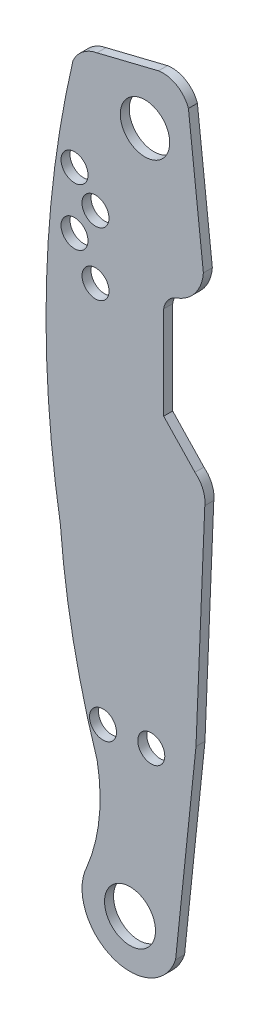
ISO-10303-21;
HEADER;
FILE_DESCRIPTION(('STEP AP214'),'2;1');
FILE_NAME('part.step','',(''),(''),'','','');
FILE_SCHEMA(('AUTOMOTIVE_DESIGN { 1 0 10303 214 1 1 1 1 }'));
ENDSEC;
DATA;
#1=APPLICATION_CONTEXT('core data for automotive mechanical design processes');
#2=APPLICATION_PROTOCOL_DEFINITION('international standard','automotive_design',2000,#1);
#3=PRODUCT_CONTEXT('',#1,'mechanical');
#4=PRODUCT('Part','Part','',(#3));
#5=PRODUCT_RELATED_PRODUCT_CATEGORY('part','',(#4));
#6=PRODUCT_DEFINITION_FORMATION('','',#4);
#7=PRODUCT_DEFINITION_CONTEXT('part definition',#1,'design');
#8=PRODUCT_DEFINITION('design','',#6,#7);
#9=PRODUCT_DEFINITION_SHAPE('','',#8);
#10=(LENGTH_UNIT() NAMED_UNIT(*) SI_UNIT(.MILLI.,.METRE.));
#11=(NAMED_UNIT(*) PLANE_ANGLE_UNIT() SI_UNIT($,.RADIAN.));
#12=(NAMED_UNIT(*) SI_UNIT($,.STERADIAN.) SOLID_ANGLE_UNIT());
#13=UNCERTAINTY_MEASURE_WITH_UNIT(LENGTH_MEASURE(1.E-05),#10,'distance_accuracy_value','');
#14=(GEOMETRIC_REPRESENTATION_CONTEXT(3) GLOBAL_UNCERTAINTY_ASSIGNED_CONTEXT((#13)) GLOBAL_UNIT_ASSIGNED_CONTEXT((#10,
#11,#12)) REPRESENTATION_CONTEXT('',''));
#15=CARTESIAN_POINT('',(0.,0.,0.));
#16=DIRECTION('',(0.,0.,1.));
#17=DIRECTION('',(1.,0.,0.));
#18=AXIS2_PLACEMENT_3D('',#15,#16,#17);
#19=CARTESIAN_POINT('',(66.1355331619009,46.4667637732928,0.381));
#20=DIRECTION('',(0.,0.,-1.));
#21=DIRECTION('',(-1.,0.,0.));
#22=AXIS2_PLACEMENT_3D('',#19,#20,#21);
#23=PLANE('',#22);
#24=CARTESIAN_POINT('',(66.1355331619009,46.4667637732928,0.381));
#25=DIRECTION('',(0.,0.,1.));
#26=DIRECTION('',(-1.,0.,0.));
#27=AXIS2_PLACEMENT_3D('',#24,#25,#26);
#28=CIRCLE('',#27,2.79400000000001);
#29=CARTESIAN_POINT('',(65.6275331619009,49.2141938451963,0.381));
#30=VERTEX_POINT('',#29);
#31=CARTESIAN_POINT('',(63.5895969047931,47.6176958193944,0.381));
#32=VERTEX_POINT('',#31);
#33=EDGE_CURVE('E203',#30,#32,#28,.T.);
#34=ORIENTED_EDGE('',*,*,#33,.T.);
#35=CARTESIAN_POINT('',(149.701533161901,27.6707637732928,0.381));
#36=DIRECTION('',(0.,0.,1.));
#37=DIRECTION('',(1.,0.,0.));
#38=AXIS2_PLACEMENT_3D('',#35,#36,#37);
#39=CIRCLE('',#38,88.392);
#40=CARTESIAN_POINT('',(62.5267867779124,13.051965707539,0.381));
#41=VERTEX_POINT('',#40);
#42=EDGE_CURVE('E116',#32,#41,#39,.T.);
#43=ORIENTED_EDGE('',*,*,#42,.T.);
#44=CARTESIAN_POINT('',(130.143533161901,18.2727637732928,0.381));
#45=DIRECTION('',(0.,0.,1.));
#46=DIRECTION('',(1.,0.,0.));
#47=AXIS2_PLACEMENT_3D('',#44,#45,#46);
#48=CIRCLE('',#47,67.818);
#49=CARTESIAN_POINT('',(65.6357854012129,-2.65644077067999,0.381));
#50=VERTEX_POINT('',#49);
#51=EDGE_CURVE('E239',#41,#50,#48,.T.);
#52=ORIENTED_EDGE('',*,*,#51,.T.);
#53=CARTESIAN_POINT('',(51.4035331619009,-5.34923622670723,0.381));
#54=DIRECTION('',(0.,0.,-1.));
#55=DIRECTION('',(-1.,0.,0.));
#56=AXIS2_PLACEMENT_3D('',#53,#54,#55);
#57=CIRCLE('',#56,14.4847558202202);
#58=CARTESIAN_POINT('',(64.7663699352265,-10.9387571847912,0.381));
#59=VERTEX_POINT('',#58);
#60=EDGE_CURVE('E258',#50,#59,#57,.T.);
#61=ORIENTED_EDGE('',*,*,#60,.T.);
#62=CARTESIAN_POINT('',(68.4215331619009,-12.7152362267072,0.381));
#63=DIRECTION('',(0.,0.,1.));
#64=DIRECTION('',(1.,0.,0.));
#65=AXIS2_PLACEMENT_3D('',#62,#63,#64);
#66=CIRCLE('',#65,4.064);
#67=CARTESIAN_POINT('',(72.2819989369079,-13.9852362267072,0.381));
#68=VERTEX_POINT('',#67);
#69=EDGE_CURVE('E255',#59,#68,#66,.T.);
#70=ORIENTED_EDGE('',*,*,#69,.T.);
#71=DIRECTION('',(0.104067481894806,0.994570238450796,0.));
#72=VECTOR('',#71,1.);
#73=CARTESIAN_POINT('',(74.0095331619009,2.52476377329277,0.381));
#74=LINE('',#73,#72);
#75=CARTESIAN_POINT('',(74.0095331619009,2.52476377329277,0.381));
#76=VERTEX_POINT('',#75);
#77=EDGE_CURVE('E257',#68,#76,#74,.T.);
#78=ORIENTED_EDGE('',*,*,#77,.T.);
#79=DIRECTION('',(0.0414330086927801,0.999141284198918,0.));
#80=VECTOR('',#79,1.);
#81=CARTESIAN_POINT('',(74.7573782270407,20.5587637732928,0.381));
#82=LINE('',#81,#80);
#83=CARTESIAN_POINT('',(74.7573782270407,20.5587637732928,0.381));
#84=VERTEX_POINT('',#83);
#85=EDGE_CURVE('E260',#76,#84,#82,.T.);
#86=ORIENTED_EDGE('',*,*,#85,.T.);
#87=CARTESIAN_POINT('',(72.4855331619009,20.8127637732928,0.381));
#88=DIRECTION('',(0.,0.,1.));
#89=DIRECTION('',(1.,0.,0.));
#90=AXIS2_PLACEMENT_3D('',#87,#88,#89);
#91=CIRCLE('',#90,2.286);
#92=CARTESIAN_POINT('',(73.922374141272,22.5907637732928,0.381));
#93=VERTEX_POINT('',#92);
#94=EDGE_CURVE('E266',#84,#93,#91,.T.);
#95=ORIENTED_EDGE('',*,*,#94,.T.);
#96=DIRECTION('',(-0.68782056768285,0.725880752377718,0.));
#97=VECTOR('',#96,1.);
#98=CARTESIAN_POINT('',(71.274872248143,25.3847637732928,0.381));
#99=LINE('',#98,#97);
#100=CARTESIAN_POINT('',(71.274872248143,25.3847637732928,0.381));
#101=VERTEX_POINT('',#100);
#102=EDGE_CURVE('E268',#93,#101,#99,.T.);
#103=ORIENTED_EDGE('',*,*,#102,.T.);
#104=DIRECTION('',(0.,1.,0.));
#105=VECTOR('',#104,1.);
#106=CARTESIAN_POINT('',(71.274872248143,33.2587637732928,0.381));
#107=LINE('',#106,#105);
#108=CARTESIAN_POINT('',(71.274872248143,33.2587637732928,0.381));
#109=VERTEX_POINT('',#108);
#110=EDGE_CURVE('E270',#101,#109,#107,.T.);
#111=ORIENTED_EDGE('',*,*,#110,.T.);
#112=CARTESIAN_POINT('',(72.9576102669683,33.0047637732928,0.381));
#113=DIRECTION('',(0.,0.,-1.));
#114=DIRECTION('',(-1.,0.,0.));
#115=AXIS2_PLACEMENT_3D('',#112,#113,#114);
#116=CIRCLE('',#115,1.7018);
#117=CARTESIAN_POINT('',(72.3797926133073,34.6054667435898,0.381));
#118=VERTEX_POINT('',#117);
#119=EDGE_CURVE('E272',#109,#118,#116,.T.);
#120=ORIENTED_EDGE('',*,*,#119,.T.);
#121=CARTESIAN_POINT('',(71.2155331619009,37.8307637732928,0.381));
#122=DIRECTION('',(0.,0.,1.));
#123=DIRECTION('',(1.,0.,0.));
#124=AXIS2_PLACEMENT_3D('',#121,#122,#123);
#125=CIRCLE('',#124,3.429);
#126=CARTESIAN_POINT('',(74.6351128144313,37.5767637732928,0.381));
#127=VERTEX_POINT('',#126);
#128=EDGE_CURVE('E156',#118,#127,#125,.T.);
#129=ORIENTED_EDGE('',*,*,#128,.T.);
#130=DIRECTION('',(-0.109943454836224,0.993937843498614,0.));
#131=VECTOR('',#130,1.);
#132=CARTESIAN_POINT('',(73.3707946309575,49.0067637732928,0.381));
#133=LINE('',#132,#131);
#134=CARTESIAN_POINT('',(73.3707946309575,49.0067637732928,0.381));
#135=VERTEX_POINT('',#134);
#136=EDGE_CURVE('E150',#127,#135,#133,.T.);
#137=ORIENTED_EDGE('',*,*,#136,.T.);
#138=CARTESIAN_POINT('',(71.2155331619009,48.2447637732928,0.381));
#139=DIRECTION('',(0.,0.,1.));
#140=DIRECTION('',(-1.,0.,0.));
#141=AXIS2_PLACEMENT_3D('',#138,#139,#140);
#142=CIRCLE('',#141,2.28600000000001);
#143=CARTESIAN_POINT('',(70.8345331619009,50.4987901706537,0.381));
#144=VERTEX_POINT('',#143);
#145=EDGE_CURVE('E154',#135,#144,#142,.T.);
#146=ORIENTED_EDGE('',*,*,#145,.T.);
#147=DIRECTION('',(-0.970890406584158,-0.239524149936595,0.));
#148=VECTOR('',#147,1.);
#149=CARTESIAN_POINT('',(65.6275331619009,49.2141938451963,0.381));
#150=LINE('',#149,#148);
#151=EDGE_CURVE('E52',#144,#30,#150,.T.);
#152=ORIENTED_EDGE('',*,*,#151,.T.);
#153=EDGE_LOOP('',(#34,#43,#52,#61,#70,#78,#86,#95,#103,#111,#120,#129,#137,#146,#152));
#154=FACE_BOUND('',#153,.T.);
#155=CARTESIAN_POINT('',(68.4215331619009,-12.7152362267072,0.381));
#156=DIRECTION('',(0.,0.,1.));
#157=DIRECTION('',(1.,0.,0.));
#158=AXIS2_PLACEMENT_3D('',#155,#156,#157);
#159=CIRCLE('',#158,2.15899999999999);
#160=CARTESIAN_POINT('',(70.5805331619009,-12.7152362267072,0.381));
#161=VERTEX_POINT('',#160);
#162=EDGE_CURVE('E178',#161,#161,#159,.T.);
#163=ORIENTED_EDGE('',*,*,#162,.F.);
#164=EDGE_LOOP('',(#163));
#165=FACE_BOUND('',#164,.T.);
#166=CARTESIAN_POINT('',(70.2249331619009,0.492763773292777,0.381));
#167=DIRECTION('',(0.,0.,1.));
#168=DIRECTION('',(1.,0.,0.));
#169=AXIS2_PLACEMENT_3D('',#166,#167,#168);
#170=CIRCLE('',#169,1.143);
#171=CARTESIAN_POINT('',(71.3679331619009,0.492763773292777,0.381));
#172=VERTEX_POINT('',#171);
#173=EDGE_CURVE('E376',#172,#172,#170,.T.);
#174=ORIENTED_EDGE('',*,*,#173,.F.);
#175=EDGE_LOOP('',(#174));
#176=FACE_BOUND('',#175,.T.);
#177=CARTESIAN_POINT('',(66.1355331619009,0.202809344150783,0.381));
#178=DIRECTION('',(0.,0.,1.));
#179=DIRECTION('',(1.,0.,0.));
#180=AXIS2_PLACEMENT_3D('',#177,#178,#179);
#181=CIRCLE('',#180,1.14299999999999);
#182=CARTESIAN_POINT('',(67.2785331619009,0.202809344150783,0.381));
#183=VERTEX_POINT('',#182);
#184=EDGE_CURVE('E370',#183,#183,#181,.T.);
#185=ORIENTED_EDGE('',*,*,#184,.F.);
#186=EDGE_LOOP('',(#185));
#187=FACE_BOUND('',#186,.T.);
#188=CARTESIAN_POINT('',(65.5005331619009,32.2427637732928,0.381));
#189=DIRECTION('',(0.,0.,1.));
#190=DIRECTION('',(1.,0.,0.));
#191=AXIS2_PLACEMENT_3D('',#188,#189,#190);
#192=CIRCLE('',#191,1.143);
#193=CARTESIAN_POINT('',(66.6435331619009,32.2427637732928,0.381));
#194=VERTEX_POINT('',#193);
#195=EDGE_CURVE('E364',#194,#194,#192,.T.);
#196=ORIENTED_EDGE('',*,*,#195,.F.);
#197=EDGE_LOOP('',(#196));
#198=FACE_BOUND('',#197,.T.);
#199=CARTESIAN_POINT('',(65.5005331619009,37.5767637732928,0.381));
#200=DIRECTION('',(0.,0.,1.));
#201=DIRECTION('',(1.,0.,0.));
#202=AXIS2_PLACEMENT_3D('',#199,#200,#201);
#203=CIRCLE('',#202,1.143);
#204=CARTESIAN_POINT('',(66.6435331619009,37.5767637732928,0.381));
#205=VERTEX_POINT('',#204);
#206=EDGE_CURVE('E358',#205,#205,#203,.T.);
#207=ORIENTED_EDGE('',*,*,#206,.F.);
#208=EDGE_LOOP('',(#207));
#209=FACE_BOUND('',#208,.T.);
#210=CARTESIAN_POINT('',(69.6915331619009,45.7047637732928,0.381));
#211=DIRECTION('',(0.,0.,1.));
#212=DIRECTION('',(1.,0.,0.));
#213=AXIS2_PLACEMENT_3D('',#210,#211,#212);
#214=CIRCLE('',#213,2.0955);
#215=CARTESIAN_POINT('',(71.7870331619009,45.7047637732928,0.381));
#216=VERTEX_POINT('',#215);
#217=EDGE_CURVE('E352',#216,#216,#214,.T.);
#218=ORIENTED_EDGE('',*,*,#217,.F.);
#219=EDGE_LOOP('',(#218));
#220=FACE_BOUND('',#219,.T.);
#221=CARTESIAN_POINT('',(63.7225331619009,39.8627637732928,0.381));
#222=DIRECTION('',(0.,0.,1.));
#223=DIRECTION('',(1.,0.,0.));
#224=AXIS2_PLACEMENT_3D('',#221,#222,#223);
#225=CIRCLE('',#224,1.14299999999999);
#226=CARTESIAN_POINT('',(64.8655331619009,39.8627637732928,0.381));
#227=VERTEX_POINT('',#226);
#228=EDGE_CURVE('E346',#227,#227,#225,.T.);
#229=ORIENTED_EDGE('',*,*,#228,.F.);
#230=EDGE_LOOP('',(#229));
#231=FACE_BOUND('',#230,.T.);
#232=CARTESIAN_POINT('',(63.7225331619009,35.0367637732928,0.381));
#233=DIRECTION('',(0.,0.,1.));
#234=DIRECTION('',(1.,0.,0.));
#235=AXIS2_PLACEMENT_3D('',#232,#233,#234);
#236=CIRCLE('',#235,1.14299999999999);
#237=CARTESIAN_POINT('',(64.8655331619009,35.0367637732928,0.381));
#238=VERTEX_POINT('',#237);
#239=EDGE_CURVE('E337',#238,#238,#236,.T.);
#240=ORIENTED_EDGE('',*,*,#239,.F.);
#241=EDGE_LOOP('',(#240));
#242=FACE_BOUND('',#241,.T.);
#243=ADVANCED_FACE('F35',(#154,#165,#176,#187,#198,#209,#220,#231,#242),#23,.F.);
#244=CARTESIAN_POINT('',(66.1355331619009,46.4667637732928,-0.381));
#245=DIRECTION('',(0.,0.,-1.));
#246=DIRECTION('',(-1.,0.,0.));
#247=AXIS2_PLACEMENT_3D('',#244,#245,#246);
#248=PLANE('',#247);
#249=CARTESIAN_POINT('',(63.7225331619009,39.8627637732928,-0.381));
#250=DIRECTION('',(0.,0.,1.));
#251=DIRECTION('',(1.,0.,0.));
#252=AXIS2_PLACEMENT_3D('',#249,#250,#251);
#253=CIRCLE('',#252,1.14299999999999);
#254=CARTESIAN_POINT('',(64.8655331619009,39.8627637732928,-0.381));
#255=VERTEX_POINT('',#254);
#256=EDGE_CURVE('E343',#255,#255,#253,.T.);
#257=ORIENTED_EDGE('',*,*,#256,.T.);
#258=EDGE_LOOP('',(#257));
#259=FACE_BOUND('',#258,.T.);
#260=CARTESIAN_POINT('',(65.5005331619009,37.5767637732928,-0.381));
#261=DIRECTION('',(0.,0.,1.));
#262=DIRECTION('',(1.,0.,0.));
#263=AXIS2_PLACEMENT_3D('',#260,#261,#262);
#264=CIRCLE('',#263,1.143);
#265=CARTESIAN_POINT('',(66.6435331619009,37.5767637732928,-0.381));
#266=VERTEX_POINT('',#265);
#267=EDGE_CURVE('E355',#266,#266,#264,.T.);
#268=ORIENTED_EDGE('',*,*,#267,.T.);
#269=EDGE_LOOP('',(#268));
#270=FACE_BOUND('',#269,.T.);
#271=CARTESIAN_POINT('',(66.1355331619009,0.202809344150783,-0.381));
#272=DIRECTION('',(0.,0.,1.));
#273=DIRECTION('',(1.,0.,0.));
#274=AXIS2_PLACEMENT_3D('',#271,#272,#273);
#275=CIRCLE('',#274,1.14299999999999);
#276=CARTESIAN_POINT('',(67.2785331619009,0.202809344150783,-0.381));
#277=VERTEX_POINT('',#276);
#278=EDGE_CURVE('E367',#277,#277,#275,.T.);
#279=ORIENTED_EDGE('',*,*,#278,.T.);
#280=EDGE_LOOP('',(#279));
#281=FACE_BOUND('',#280,.T.);
#282=CARTESIAN_POINT('',(68.4215331619009,-12.7152362267072,-0.381));
#283=DIRECTION('',(0.,0.,1.));
#284=DIRECTION('',(1.,0.,0.));
#285=AXIS2_PLACEMENT_3D('',#282,#283,#284);
#286=CIRCLE('',#285,2.15899999999999);
#287=CARTESIAN_POINT('',(70.5805331619009,-12.7152362267072,-0.381));
#288=VERTEX_POINT('',#287);
#289=EDGE_CURVE('E379',#288,#288,#286,.T.);
#290=ORIENTED_EDGE('',*,*,#289,.T.);
#291=EDGE_LOOP('',(#290));
#292=FACE_BOUND('',#291,.T.);
#293=CARTESIAN_POINT('',(66.1355331619009,46.4667637732928,-0.381));
#294=DIRECTION('',(0.,0.,1.));
#295=DIRECTION('',(-1.,0.,0.));
#296=AXIS2_PLACEMENT_3D('',#293,#294,#295);
#297=CIRCLE('',#296,2.79400000000001);
#298=CARTESIAN_POINT('',(65.6275331619009,49.2141938451963,-0.381));
#299=VERTEX_POINT('',#298);
#300=CARTESIAN_POINT('',(63.5895969047931,47.6176958193944,-0.381));
#301=VERTEX_POINT('',#300);
#302=EDGE_CURVE('E174',#299,#301,#297,.T.);
#303=ORIENTED_EDGE('',*,*,#302,.F.);
#304=DIRECTION('',(-0.970890406584158,-0.239524149936595,0.));
#305=VECTOR('',#304,1.);
#306=CARTESIAN_POINT('',(65.6275331619009,49.2141938451963,-0.381));
#307=LINE('',#306,#305);
#308=CARTESIAN_POINT('',(70.8345331619009,50.4987901706537,-0.381));
#309=VERTEX_POINT('',#308);
#310=EDGE_CURVE('E108',#309,#299,#307,.T.);
#311=ORIENTED_EDGE('',*,*,#310,.F.);
#312=CARTESIAN_POINT('',(71.2155331619009,48.2447637732928,-0.381));
#313=DIRECTION('',(0.,0.,1.));
#314=DIRECTION('',(-1.,0.,0.));
#315=AXIS2_PLACEMENT_3D('',#312,#313,#314);
#316=CIRCLE('',#315,2.28600000000001);
#317=CARTESIAN_POINT('',(73.3707946309575,49.0067637732928,-0.381));
#318=VERTEX_POINT('',#317);
#319=EDGE_CURVE('E102',#318,#309,#316,.T.);
#320=ORIENTED_EDGE('',*,*,#319,.F.);
#321=DIRECTION('',(-0.109943454836224,0.993937843498614,0.));
#322=VECTOR('',#321,1.);
#323=CARTESIAN_POINT('',(73.3707946309575,49.0067637732928,-0.381));
#324=LINE('',#323,#322);
#325=CARTESIAN_POINT('',(74.6351128144313,37.5767637732928,-0.381));
#326=VERTEX_POINT('',#325);
#327=EDGE_CURVE('E164',#326,#318,#324,.T.);
#328=ORIENTED_EDGE('',*,*,#327,.F.);
#329=CARTESIAN_POINT('',(71.2155331619009,37.8307637732928,-0.381));
#330=DIRECTION('',(0.,0.,1.));
#331=DIRECTION('',(1.,0.,0.));
#332=AXIS2_PLACEMENT_3D('',#329,#330,#331);
#333=CIRCLE('',#332,3.429);
#334=CARTESIAN_POINT('',(72.3797926133073,34.6054667435898,-0.381));
#335=VERTEX_POINT('',#334);
#336=EDGE_CURVE('E198',#335,#326,#333,.T.);
#337=ORIENTED_EDGE('',*,*,#336,.F.);
#338=CARTESIAN_POINT('',(72.9576102669683,33.0047637732928,-0.381));
#339=DIRECTION('',(0.,0.,-1.));
#340=DIRECTION('',(-1.,0.,0.));
#341=AXIS2_PLACEMENT_3D('',#338,#339,#340);
#342=CIRCLE('',#341,1.7018);
#343=CARTESIAN_POINT('',(71.274872248143,33.2587637732928,-0.381));
#344=VERTEX_POINT('',#343);
#345=EDGE_CURVE('E196',#344,#335,#342,.T.);
#346=ORIENTED_EDGE('',*,*,#345,.F.);
#347=DIRECTION('',(0.,1.,0.));
#348=VECTOR('',#347,1.);
#349=CARTESIAN_POINT('',(71.274872248143,33.2587637732928,-0.381));
#350=LINE('',#349,#348);
#351=CARTESIAN_POINT('',(71.274872248143,25.3847637732928,-0.381));
#352=VERTEX_POINT('',#351);
#353=EDGE_CURVE('E194',#352,#344,#350,.T.);
#354=ORIENTED_EDGE('',*,*,#353,.F.);
#355=DIRECTION('',(-0.68782056768285,0.725880752377718,0.));
#356=VECTOR('',#355,1.);
#357=CARTESIAN_POINT('',(71.274872248143,25.3847637732928,-0.381));
#358=LINE('',#357,#356);
#359=CARTESIAN_POINT('',(73.922374141272,22.5907637732928,-0.381));
#360=VERTEX_POINT('',#359);
#361=EDGE_CURVE('E192',#360,#352,#358,.T.);
#362=ORIENTED_EDGE('',*,*,#361,.F.);
#363=CARTESIAN_POINT('',(72.4855331619009,20.8127637732928,-0.381));
#364=DIRECTION('',(0.,0.,1.));
#365=DIRECTION('',(1.,0.,0.));
#366=AXIS2_PLACEMENT_3D('',#363,#364,#365);
#367=CIRCLE('',#366,2.286);
#368=CARTESIAN_POINT('',(74.7573782270407,20.5587637732928,-0.381));
#369=VERTEX_POINT('',#368);
#370=EDGE_CURVE('E190',#369,#360,#367,.T.);
#371=ORIENTED_EDGE('',*,*,#370,.F.);
#372=DIRECTION('',(0.0414330086927801,0.999141284198918,0.));
#373=VECTOR('',#372,1.);
#374=CARTESIAN_POINT('',(74.7573782270407,20.5587637732928,-0.381));
#375=LINE('',#374,#373);
#376=CARTESIAN_POINT('',(74.0095331619009,2.52476377329277,-0.381));
#377=VERTEX_POINT('',#376);
#378=EDGE_CURVE('E188',#377,#369,#375,.T.);
#379=ORIENTED_EDGE('',*,*,#378,.F.);
#380=DIRECTION('',(0.104067481894806,0.994570238450796,0.));
#381=VECTOR('',#380,1.);
#382=CARTESIAN_POINT('',(74.0095331619009,2.52476377329277,-0.381));
#383=LINE('',#382,#381);
#384=CARTESIAN_POINT('',(72.2819989369079,-13.9852362267072,-0.381));
#385=VERTEX_POINT('',#384);
#386=EDGE_CURVE('E186',#385,#377,#383,.T.);
#387=ORIENTED_EDGE('',*,*,#386,.F.);
#388=CARTESIAN_POINT('',(68.4215331619009,-12.7152362267072,-0.381));
#389=DIRECTION('',(0.,0.,1.));
#390=DIRECTION('',(1.,0.,0.));
#391=AXIS2_PLACEMENT_3D('',#388,#389,#390);
#392=CIRCLE('',#391,4.064);
#393=CARTESIAN_POINT('',(64.7663699352265,-10.9387571847912,-0.381));
#394=VERTEX_POINT('',#393);
#395=EDGE_CURVE('E184',#394,#385,#392,.T.);
#396=ORIENTED_EDGE('',*,*,#395,.F.);
#397=CARTESIAN_POINT('',(51.4035331619009,-5.34923622670723,-0.381));
#398=DIRECTION('',(0.,0.,-1.));
#399=DIRECTION('',(-1.,0.,0.));
#400=AXIS2_PLACEMENT_3D('',#397,#398,#399);
#401=CIRCLE('',#400,14.4847558202202);
#402=CARTESIAN_POINT('',(65.6357854012129,-2.65644077067999,-0.381));
#403=VERTEX_POINT('',#402);
#404=EDGE_CURVE('E182',#403,#394,#401,.T.);
#405=ORIENTED_EDGE('',*,*,#404,.F.);
#406=CARTESIAN_POINT('',(130.143533161901,18.2727637732928,-0.381));
#407=DIRECTION('',(0.,0.,1.));
#408=DIRECTION('',(1.,0.,0.));
#409=AXIS2_PLACEMENT_3D('',#406,#407,#408);
#410=CIRCLE('',#409,67.818);
#411=CARTESIAN_POINT('',(62.5267867779124,13.051965707539,-0.381));
#412=VERTEX_POINT('',#411);
#413=EDGE_CURVE('E180',#412,#403,#410,.T.);
#414=ORIENTED_EDGE('',*,*,#413,.F.);
#415=CARTESIAN_POINT('',(149.701533161901,27.6707637732928,-0.381));
#416=DIRECTION('',(0.,0.,1.));
#417=DIRECTION('',(1.,0.,0.));
#418=AXIS2_PLACEMENT_3D('',#415,#416,#417);
#419=CIRCLE('',#418,88.392);
#420=EDGE_CURVE('E177',#301,#412,#419,.T.);
#421=ORIENTED_EDGE('',*,*,#420,.F.);
#422=EDGE_LOOP('',(#303,#311,#320,#328,#337,#346,#354,#362,#371,#379,#387,#396,#405,#414,#421));
#423=FACE_BOUND('',#422,.T.);
#424=CARTESIAN_POINT('',(70.2249331619009,0.492763773292777,-0.381));
#425=DIRECTION('',(0.,0.,1.));
#426=DIRECTION('',(1.,0.,0.));
#427=AXIS2_PLACEMENT_3D('',#424,#425,#426);
#428=CIRCLE('',#427,1.143);
#429=CARTESIAN_POINT('',(71.3679331619009,0.492763773292777,-0.381));
#430=VERTEX_POINT('',#429);
#431=EDGE_CURVE('E373',#430,#430,#428,.T.);
#432=ORIENTED_EDGE('',*,*,#431,.T.);
#433=EDGE_LOOP('',(#432));
#434=FACE_BOUND('',#433,.T.);
#435=CARTESIAN_POINT('',(65.5005331619009,32.2427637732928,-0.381));
#436=DIRECTION('',(0.,0.,1.));
#437=DIRECTION('',(1.,0.,0.));
#438=AXIS2_PLACEMENT_3D('',#435,#436,#437);
#439=CIRCLE('',#438,1.143);
#440=CARTESIAN_POINT('',(66.6435331619009,32.2427637732928,-0.381));
#441=VERTEX_POINT('',#440);
#442=EDGE_CURVE('E361',#441,#441,#439,.T.);
#443=ORIENTED_EDGE('',*,*,#442,.T.);
#444=EDGE_LOOP('',(#443));
#445=FACE_BOUND('',#444,.T.);
#446=CARTESIAN_POINT('',(69.6915331619009,45.7047637732928,-0.381));
#447=DIRECTION('',(0.,0.,1.));
#448=DIRECTION('',(1.,0.,0.));
#449=AXIS2_PLACEMENT_3D('',#446,#447,#448);
#450=CIRCLE('',#449,2.0955);
#451=CARTESIAN_POINT('',(71.7870331619009,45.7047637732928,-0.381));
#452=VERTEX_POINT('',#451);
#453=EDGE_CURVE('E349',#452,#452,#450,.T.);
#454=ORIENTED_EDGE('',*,*,#453,.T.);
#455=EDGE_LOOP('',(#454));
#456=FACE_BOUND('',#455,.T.);
#457=CARTESIAN_POINT('',(63.7225331619009,35.0367637732928,-0.381));
#458=DIRECTION('',(0.,0.,1.));
#459=DIRECTION('',(1.,0.,0.));
#460=AXIS2_PLACEMENT_3D('',#457,#458,#459);
#461=CIRCLE('',#460,1.14299999999999);
#462=CARTESIAN_POINT('',(64.8655331619009,35.0367637732928,-0.381));
#463=VERTEX_POINT('',#462);
#464=EDGE_CURVE('E340',#463,#463,#461,.T.);
#465=ORIENTED_EDGE('',*,*,#464,.T.);
#466=EDGE_LOOP('',(#465));
#467=FACE_BOUND('',#466,.T.);
#468=ADVANCED_FACE('F243',(#259,#270,#281,#292,#423,#434,#445,#456,#467),#248,.T.);
#469=CARTESIAN_POINT('',(66.1355331619009,46.4667637732928,0.381));
#470=DIRECTION('',(0.,0.,-1.));
#471=DIRECTION('',(-1.,0.,0.));
#472=AXIS2_PLACEMENT_3D('',#469,#470,#471);
#473=CYLINDRICAL_SURFACE('',#472,2.79400000000001);
#474=ORIENTED_EDGE('',*,*,#302,.T.);
#475=DIRECTION('',(0.,0.,-1.));
#476=VECTOR('',#475,1.);
#477=CARTESIAN_POINT('',(63.5895969047931,47.6176958193944,0.381));
#478=LINE('',#477,#476);
#479=EDGE_CURVE('E11',#32,#301,#478,.T.);
#480=ORIENTED_EDGE('',*,*,#479,.F.);
#481=ORIENTED_EDGE('',*,*,#33,.F.);
#482=DIRECTION('',(0.,0.,-1.));
#483=VECTOR('',#482,1.);
#484=CARTESIAN_POINT('',(65.6275331619009,49.2141938451963,0.381));
#485=LINE('',#484,#483);
#486=EDGE_CURVE('E170',#30,#299,#485,.T.);
#487=ORIENTED_EDGE('',*,*,#486,.T.);
#488=EDGE_LOOP('',(#474,#480,#481,#487));
#489=FACE_BOUND('',#488,.T.);
#490=ADVANCED_FACE('F37',(#489),#473,.T.);
#491=CARTESIAN_POINT('',(149.701533161901,27.6707637732928,0.381));
#492=DIRECTION('',(0.,0.,-1.));
#493=DIRECTION('',(-1.,0.,0.));
#494=AXIS2_PLACEMENT_3D('',#491,#492,#493);
#495=CYLINDRICAL_SURFACE('',#494,88.392);
#496=ORIENTED_EDGE('',*,*,#420,.T.);
#497=DIRECTION('',(0.,0.,-1.));
#498=VECTOR('',#497,1.);
#499=CARTESIAN_POINT('',(62.5267867779124,13.051965707539,0.381));
#500=LINE('',#499,#498);
#501=EDGE_CURVE('E44',#41,#412,#500,.T.);
#502=ORIENTED_EDGE('',*,*,#501,.F.);
#503=ORIENTED_EDGE('',*,*,#42,.F.);
#504=ORIENTED_EDGE('',*,*,#479,.T.);
#505=EDGE_LOOP('',(#496,#502,#503,#504));
#506=FACE_BOUND('',#505,.T.);
#507=ADVANCED_FACE('F557',(#506),#495,.T.);
#508=CARTESIAN_POINT('',(130.143533161901,18.2727637732928,0.381));
#509=DIRECTION('',(0.,0.,-1.));
#510=DIRECTION('',(-1.,0.,0.));
#511=AXIS2_PLACEMENT_3D('',#508,#509,#510);
#512=CYLINDRICAL_SURFACE('',#511,67.818);
#513=ORIENTED_EDGE('',*,*,#413,.T.);
#514=DIRECTION('',(0.,0.,-1.));
#515=VECTOR('',#514,1.);
#516=CARTESIAN_POINT('',(65.6357854012129,-2.65644077067999,0.381));
#517=LINE('',#516,#515);
#518=EDGE_CURVE('E231',#50,#403,#517,.T.);
#519=ORIENTED_EDGE('',*,*,#518,.F.);
#520=ORIENTED_EDGE('',*,*,#51,.F.);
#521=ORIENTED_EDGE('',*,*,#501,.T.);
#522=EDGE_LOOP('',(#513,#519,#520,#521));
#523=FACE_BOUND('',#522,.T.);
#524=ADVANCED_FACE('F237',(#523),#512,.T.);
#525=CARTESIAN_POINT('',(51.4035331619009,-5.34923622670723,0.381));
#526=DIRECTION('',(0.,0.,-1.));
#527=DIRECTION('',(-1.,0.,0.));
#528=AXIS2_PLACEMENT_3D('',#525,#526,#527);
#529=CYLINDRICAL_SURFACE('',#528,14.4847558202202);
#530=ORIENTED_EDGE('',*,*,#404,.T.);
#531=DIRECTION('',(0.,0.,-1.));
#532=VECTOR('',#531,1.);
#533=CARTESIAN_POINT('',(64.7663699352265,-10.9387571847912,0.381));
#534=LINE('',#533,#532);
#535=EDGE_CURVE('E228',#59,#394,#534,.T.);
#536=ORIENTED_EDGE('',*,*,#535,.F.);
#537=ORIENTED_EDGE('',*,*,#60,.F.);
#538=ORIENTED_EDGE('',*,*,#518,.T.);
#539=EDGE_LOOP('',(#530,#536,#537,#538));
#540=FACE_BOUND('',#539,.T.);
#541=ADVANCED_FACE('F249',(#540),#529,.F.);
#542=CARTESIAN_POINT('',(68.4215331619009,-12.7152362267072,0.381));
#543=DIRECTION('',(0.,0.,-1.));
#544=DIRECTION('',(-1.,0.,0.));
#545=AXIS2_PLACEMENT_3D('',#542,#543,#544);
#546=CYLINDRICAL_SURFACE('',#545,4.064);
#547=ORIENTED_EDGE('',*,*,#395,.T.);
#548=DIRECTION('',(0.,0.,-1.));
#549=VECTOR('',#548,1.);
#550=CARTESIAN_POINT('',(72.2819989369079,-13.9852362267072,0.381));
#551=LINE('',#550,#549);
#552=EDGE_CURVE('E225',#68,#385,#551,.T.);
#553=ORIENTED_EDGE('',*,*,#552,.F.);
#554=ORIENTED_EDGE('',*,*,#69,.F.);
#555=ORIENTED_EDGE('',*,*,#535,.T.);
#556=EDGE_LOOP('',(#547,#553,#554,#555));
#557=FACE_BOUND('',#556,.T.);
#558=ADVANCED_FACE('F253',(#557),#546,.T.);
#559=CARTESIAN_POINT('',(74.0095331619009,2.52476377329277,0.381));
#560=DIRECTION('',(-0.994570238450797,0.104067481894806,0.));
#561=DIRECTION('',(-0.104067481894806,-0.994570238450797,0.));
#562=AXIS2_PLACEMENT_3D('',#559,#560,#561);
#563=PLANE('',#562);
#564=ORIENTED_EDGE('',*,*,#386,.T.);
#565=DIRECTION('',(0.,0.,-1.));
#566=VECTOR('',#565,1.);
#567=CARTESIAN_POINT('',(74.0095331619009,2.52476377329277,0.381));
#568=LINE('',#567,#566);
#569=EDGE_CURVE('E222',#76,#377,#568,.T.);
#570=ORIENTED_EDGE('',*,*,#569,.F.);
#571=ORIENTED_EDGE('',*,*,#77,.F.);
#572=ORIENTED_EDGE('',*,*,#552,.T.);
#573=EDGE_LOOP('',(#564,#570,#571,#572));
#574=FACE_BOUND('',#573,.T.);
#575=ADVANCED_FACE('F522',(#574),#563,.F.);
#576=CARTESIAN_POINT('',(74.7573782270407,20.5587637732928,0.381));
#577=DIRECTION('',(-0.999141284198918,0.0414330086927801,0.));
#578=DIRECTION('',(-0.0414330086927802,-0.999141284198919,0.));
#579=AXIS2_PLACEMENT_3D('',#576,#577,#578);
#580=PLANE('',#579);
#581=ORIENTED_EDGE('',*,*,#378,.T.);
#582=DIRECTION('',(0.,0.,-1.));
#583=VECTOR('',#582,1.);
#584=CARTESIAN_POINT('',(74.7573782270407,20.5587637732928,0.381));
#585=LINE('',#584,#583);
#586=EDGE_CURVE('E219',#84,#369,#585,.T.);
#587=ORIENTED_EDGE('',*,*,#586,.F.);
#588=ORIENTED_EDGE('',*,*,#85,.F.);
#589=ORIENTED_EDGE('',*,*,#569,.T.);
#590=EDGE_LOOP('',(#581,#587,#588,#589));
#591=FACE_BOUND('',#590,.T.);
#592=ADVANCED_FACE('F512',(#591),#580,.F.);
#593=CARTESIAN_POINT('',(72.4855331619009,20.8127637732928,0.381));
#594=DIRECTION('',(0.,0.,-1.));
#595=DIRECTION('',(-1.,0.,0.));
#596=AXIS2_PLACEMENT_3D('',#593,#594,#595);
#597=CYLINDRICAL_SURFACE('',#596,2.286);
#598=ORIENTED_EDGE('',*,*,#370,.T.);
#599=DIRECTION('',(0.,0.,-1.));
#600=VECTOR('',#599,1.);
#601=CARTESIAN_POINT('',(73.922374141272,22.5907637732928,0.381));
#602=LINE('',#601,#600);
#603=EDGE_CURVE('E216',#93,#360,#602,.T.);
#604=ORIENTED_EDGE('',*,*,#603,.F.);
#605=ORIENTED_EDGE('',*,*,#94,.F.);
#606=ORIENTED_EDGE('',*,*,#586,.T.);
#607=EDGE_LOOP('',(#598,#604,#605,#606));
#608=FACE_BOUND('',#607,.T.);
#609=ADVANCED_FACE('F502',(#608),#597,.T.);
#610=CARTESIAN_POINT('',(71.274872248143,25.3847637732928,0.381));
#611=DIRECTION('',(-0.725880752377718,-0.68782056768285,0.));
#612=DIRECTION('',(0.68782056768285,-0.725880752377718,0.));
#613=AXIS2_PLACEMENT_3D('',#610,#611,#612);
#614=PLANE('',#613);
#615=ORIENTED_EDGE('',*,*,#361,.T.);
#616=DIRECTION('',(0.,0.,-1.));
#617=VECTOR('',#616,1.);
#618=CARTESIAN_POINT('',(71.274872248143,25.3847637732928,0.381));
#619=LINE('',#618,#617);
#620=EDGE_CURVE('E213',#101,#352,#619,.T.);
#621=ORIENTED_EDGE('',*,*,#620,.F.);
#622=ORIENTED_EDGE('',*,*,#102,.F.);
#623=ORIENTED_EDGE('',*,*,#603,.T.);
#624=EDGE_LOOP('',(#615,#621,#622,#623));
#625=FACE_BOUND('',#624,.T.);
#626=ADVANCED_FACE('F492',(#625),#614,.F.);
#627=CARTESIAN_POINT('',(71.274872248143,33.2587637732928,0.381));
#628=DIRECTION('',(-1.,0.,0.));
#629=DIRECTION('',(0.,0.,1.));
#630=AXIS2_PLACEMENT_3D('',#627,#628,#629);
#631=PLANE('',#630);
#632=ORIENTED_EDGE('',*,*,#353,.T.);
#633=DIRECTION('',(0.,0.,-1.));
#634=VECTOR('',#633,1.);
#635=CARTESIAN_POINT('',(71.274872248143,33.2587637732928,0.381));
#636=LINE('',#635,#634);
#637=EDGE_CURVE('E210',#109,#344,#636,.T.);
#638=ORIENTED_EDGE('',*,*,#637,.F.);
#639=ORIENTED_EDGE('',*,*,#110,.F.);
#640=ORIENTED_EDGE('',*,*,#620,.T.);
#641=EDGE_LOOP('',(#632,#638,#639,#640));
#642=FACE_BOUND('',#641,.T.);
#643=ADVANCED_FACE('F483',(#642),#631,.F.);
#644=CARTESIAN_POINT('',(72.9576102669683,33.0047637732928,0.381));
#645=DIRECTION('',(0.,0.,-1.));
#646=DIRECTION('',(-1.,0.,0.));
#647=AXIS2_PLACEMENT_3D('',#644,#645,#646);
#648=CYLINDRICAL_SURFACE('',#647,1.7018);
#649=ORIENTED_EDGE('',*,*,#345,.T.);
#650=DIRECTION('',(0.,0.,-1.));
#651=VECTOR('',#650,1.);
#652=CARTESIAN_POINT('',(72.3797926133073,34.6054667435898,0.381));
#653=LINE('',#652,#651);
#654=EDGE_CURVE('E207',#118,#335,#653,.T.);
#655=ORIENTED_EDGE('',*,*,#654,.F.);
#656=ORIENTED_EDGE('',*,*,#119,.F.);
#657=ORIENTED_EDGE('',*,*,#637,.T.);
#658=EDGE_LOOP('',(#649,#655,#656,#657));
#659=FACE_BOUND('',#658,.T.);
#660=ADVANCED_FACE('F278',(#659),#648,.F.);
#661=CARTESIAN_POINT('',(71.2155331619009,37.8307637732928,0.381));
#662=DIRECTION('',(0.,0.,-1.));
#663=DIRECTION('',(-1.,0.,0.));
#664=AXIS2_PLACEMENT_3D('',#661,#662,#663);
#665=CYLINDRICAL_SURFACE('',#664,3.429);
#666=ORIENTED_EDGE('',*,*,#336,.T.);
#667=DIRECTION('',(0.,0.,-1.));
#668=VECTOR('',#667,1.);
#669=CARTESIAN_POINT('',(74.6351128144313,37.5767637732928,0.381));
#670=LINE('',#669,#668);
#671=EDGE_CURVE('E165',#127,#326,#670,.T.);
#672=ORIENTED_EDGE('',*,*,#671,.F.);
#673=ORIENTED_EDGE('',*,*,#128,.F.);
#674=ORIENTED_EDGE('',*,*,#654,.T.);
#675=EDGE_LOOP('',(#666,#672,#673,#674));
#676=FACE_BOUND('',#675,.T.);
#677=ADVANCED_FACE('F282',(#676),#665,.T.);
#678=CARTESIAN_POINT('',(73.3707946309575,49.0067637732928,0.381));
#679=DIRECTION('',(-0.993937843498614,-0.109943454836224,0.));
#680=DIRECTION('',(0.109943454836224,-0.993937843498614,0.));
#681=AXIS2_PLACEMENT_3D('',#678,#679,#680);
#682=PLANE('',#681);
#683=ORIENTED_EDGE('',*,*,#327,.T.);
#684=DIRECTION('',(0.,0.,-1.));
#685=VECTOR('',#684,1.);
#686=CARTESIAN_POINT('',(73.3707946309575,49.0067637732928,0.381));
#687=LINE('',#686,#685);
#688=EDGE_CURVE('E161',#135,#318,#687,.T.);
#689=ORIENTED_EDGE('',*,*,#688,.F.);
#690=ORIENTED_EDGE('',*,*,#136,.F.);
#691=ORIENTED_EDGE('',*,*,#671,.T.);
#692=EDGE_LOOP('',(#683,#689,#690,#691));
#693=FACE_BOUND('',#692,.T.);
#694=ADVANCED_FACE('F162',(#693),#682,.F.);
#695=CARTESIAN_POINT('',(71.2155331619009,48.2447637732928,0.381));
#696=DIRECTION('',(0.,0.,-1.));
#697=DIRECTION('',(-1.,0.,0.));
#698=AXIS2_PLACEMENT_3D('',#695,#696,#697);
#699=CYLINDRICAL_SURFACE('',#698,2.28600000000001);
#700=ORIENTED_EDGE('',*,*,#319,.T.);
#701=DIRECTION('',(0.,0.,-1.));
#702=VECTOR('',#701,1.);
#703=CARTESIAN_POINT('',(70.8345331619009,50.4987901706537,0.381));
#704=LINE('',#703,#702);
#705=EDGE_CURVE('E166',#144,#309,#704,.T.);
#706=ORIENTED_EDGE('',*,*,#705,.F.);
#707=ORIENTED_EDGE('',*,*,#145,.F.);
#708=ORIENTED_EDGE('',*,*,#688,.T.);
#709=EDGE_LOOP('',(#700,#706,#707,#708));
#710=FACE_BOUND('',#709,.T.);
#711=ADVANCED_FACE('F168',(#710),#699,.T.);
#712=CARTESIAN_POINT('',(65.6275331619009,49.2141938451963,0.381));
#713=DIRECTION('',(0.239524149936595,-0.970890406584158,0.));
#714=DIRECTION('',(0.970890406584158,0.239524149936596,0.));
#715=AXIS2_PLACEMENT_3D('',#712,#713,#714);
#716=PLANE('',#715);
#717=ORIENTED_EDGE('',*,*,#310,.T.);
#718=ORIENTED_EDGE('',*,*,#486,.F.);
#719=ORIENTED_EDGE('',*,*,#151,.F.);
#720=ORIENTED_EDGE('',*,*,#705,.T.);
#721=EDGE_LOOP('',(#717,#718,#719,#720));
#722=FACE_BOUND('',#721,.T.);
#723=ADVANCED_FACE('F286',(#722),#716,.F.);
#724=CARTESIAN_POINT('',(68.4215331619009,-12.7152362267072,0.381));
#725=DIRECTION('',(0.,0.,-1.));
#726=DIRECTION('',(-1.,0.,0.));
#727=AXIS2_PLACEMENT_3D('',#724,#725,#726);
#728=CYLINDRICAL_SURFACE('',#727,2.15899999999999);
#729=ORIENTED_EDGE('',*,*,#162,.T.);
#730=EDGE_LOOP('',(#729));
#731=FACE_BOUND('',#730,.T.);
#732=ORIENTED_EDGE('',*,*,#289,.F.);
#733=EDGE_LOOP('',(#732));
#734=FACE_BOUND('',#733,.T.);
#735=ADVANCED_FACE('F288',(#731,#734),#728,.F.);
#736=CARTESIAN_POINT('',(70.2249331619009,0.492763773292777,0.381));
#737=DIRECTION('',(0.,0.,-1.));
#738=DIRECTION('',(-1.,0.,0.));
#739=AXIS2_PLACEMENT_3D('',#736,#737,#738);
#740=CYLINDRICAL_SURFACE('',#739,1.143);
#741=ORIENTED_EDGE('',*,*,#173,.T.);
#742=EDGE_LOOP('',(#741));
#743=FACE_BOUND('',#742,.T.);
#744=ORIENTED_EDGE('',*,*,#431,.F.);
#745=EDGE_LOOP('',(#744));
#746=FACE_BOUND('',#745,.T.);
#747=ADVANCED_FACE('F294',(#743,#746),#740,.F.);
#748=CARTESIAN_POINT('',(66.1355331619009,0.202809344150783,0.381));
#749=DIRECTION('',(0.,0.,-1.));
#750=DIRECTION('',(-1.,0.,0.));
#751=AXIS2_PLACEMENT_3D('',#748,#749,#750);
#752=CYLINDRICAL_SURFACE('',#751,1.14299999999999);
#753=ORIENTED_EDGE('',*,*,#184,.T.);
#754=EDGE_LOOP('',(#753));
#755=FACE_BOUND('',#754,.T.);
#756=ORIENTED_EDGE('',*,*,#278,.F.);
#757=EDGE_LOOP('',(#756));
#758=FACE_BOUND('',#757,.T.);
#759=ADVANCED_FACE('F308',(#755,#758),#752,.F.);
#760=CARTESIAN_POINT('',(65.5005331619009,32.2427637732928,0.381));
#761=DIRECTION('',(0.,0.,-1.));
#762=DIRECTION('',(-1.,0.,0.));
#763=AXIS2_PLACEMENT_3D('',#760,#761,#762);
#764=CYLINDRICAL_SURFACE('',#763,1.143);
#765=ORIENTED_EDGE('',*,*,#195,.T.);
#766=EDGE_LOOP('',(#765));
#767=FACE_BOUND('',#766,.T.);
#768=ORIENTED_EDGE('',*,*,#442,.F.);
#769=EDGE_LOOP('',(#768));
#770=FACE_BOUND('',#769,.T.);
#771=ADVANCED_FACE('F312',(#767,#770),#764,.F.);
#772=CARTESIAN_POINT('',(65.5005331619009,37.5767637732928,0.381));
#773=DIRECTION('',(0.,0.,-1.));
#774=DIRECTION('',(-1.,0.,0.));
#775=AXIS2_PLACEMENT_3D('',#772,#773,#774);
#776=CYLINDRICAL_SURFACE('',#775,1.143);
#777=ORIENTED_EDGE('',*,*,#206,.T.);
#778=EDGE_LOOP('',(#777));
#779=FACE_BOUND('',#778,.T.);
#780=ORIENTED_EDGE('',*,*,#267,.F.);
#781=EDGE_LOOP('',(#780));
#782=FACE_BOUND('',#781,.T.);
#783=ADVANCED_FACE('F316',(#779,#782),#776,.F.);
#784=CARTESIAN_POINT('',(69.6915331619009,45.7047637732928,0.381));
#785=DIRECTION('',(0.,0.,-1.));
#786=DIRECTION('',(-1.,0.,0.));
#787=AXIS2_PLACEMENT_3D('',#784,#785,#786);
#788=CYLINDRICAL_SURFACE('',#787,2.0955);
#789=ORIENTED_EDGE('',*,*,#217,.T.);
#790=EDGE_LOOP('',(#789));
#791=FACE_BOUND('',#790,.T.);
#792=ORIENTED_EDGE('',*,*,#453,.F.);
#793=EDGE_LOOP('',(#792));
#794=FACE_BOUND('',#793,.T.);
#795=ADVANCED_FACE('F320',(#791,#794),#788,.F.);
#796=CARTESIAN_POINT('',(63.7225331619009,39.8627637732928,0.381));
#797=DIRECTION('',(0.,0.,-1.));
#798=DIRECTION('',(-1.,0.,0.));
#799=AXIS2_PLACEMENT_3D('',#796,#797,#798);
#800=CYLINDRICAL_SURFACE('',#799,1.14299999999999);
#801=ORIENTED_EDGE('',*,*,#228,.T.);
#802=EDGE_LOOP('',(#801));
#803=FACE_BOUND('',#802,.T.);
#804=ORIENTED_EDGE('',*,*,#256,.F.);
#805=EDGE_LOOP('',(#804));
#806=FACE_BOUND('',#805,.T.);
#807=ADVANCED_FACE('F324',(#803,#806),#800,.F.);
#808=CARTESIAN_POINT('',(63.7225331619009,35.0367637732928,0.381));
#809=DIRECTION('',(0.,0.,-1.));
#810=DIRECTION('',(-1.,0.,0.));
#811=AXIS2_PLACEMENT_3D('',#808,#809,#810);
#812=CYLINDRICAL_SURFACE('',#811,1.14299999999999);
#813=ORIENTED_EDGE('',*,*,#239,.T.);
#814=EDGE_LOOP('',(#813));
#815=FACE_BOUND('',#814,.T.);
#816=ORIENTED_EDGE('',*,*,#464,.F.);
#817=EDGE_LOOP('',(#816));
#818=FACE_BOUND('',#817,.T.);
#819=ADVANCED_FACE('F328',(#815,#818),#812,.F.);
#820=CLOSED_SHELL('',(#243,#468,#490,#507,#524,#541,#558,#575,#592,#609,#626,#643,#660,#677,
#694,#711,#723,#735,#747,#759,#771,#783,#795,#807,#819));
#821=MANIFOLD_SOLID_BREP('B2',#820);
#822=ADVANCED_BREP_SHAPE_REPRESENTATION('',(#18,#821),#14);
#823=SHAPE_DEFINITION_REPRESENTATION(#9,#822);
ENDSEC;
END-ISO-10303-21;
